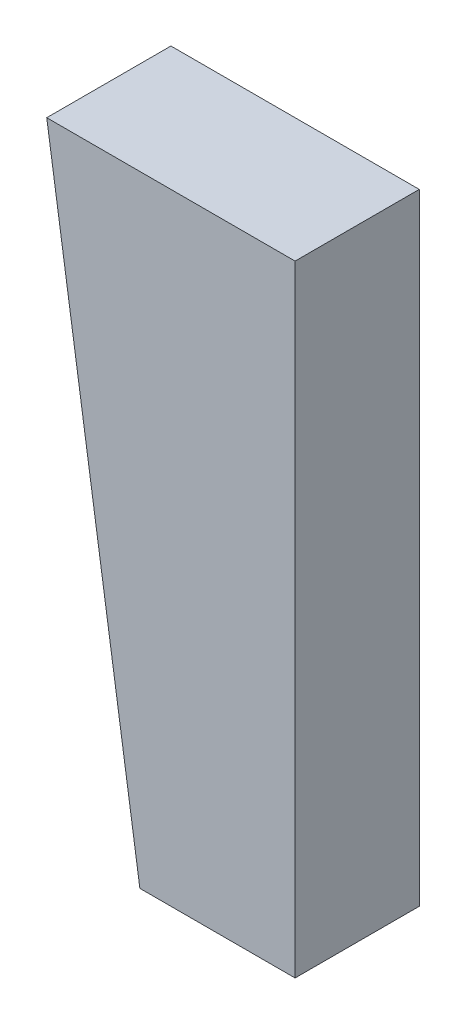
ISO-10303-21;
HEADER;
FILE_DESCRIPTION(('STEP AP214'),'2;1');
FILE_NAME('part.step','',(''),(''),'','','');
FILE_SCHEMA(('AUTOMOTIVE_DESIGN { 1 0 10303 214 1 1 1 1 }'));
ENDSEC;
DATA;
#1=APPLICATION_CONTEXT('core data for automotive mechanical design processes');
#2=APPLICATION_PROTOCOL_DEFINITION('international standard','automotive_design',2000,#1);
#3=PRODUCT_CONTEXT('',#1,'mechanical');
#4=PRODUCT('Part','Part','',(#3));
#5=PRODUCT_RELATED_PRODUCT_CATEGORY('part','',(#4));
#6=PRODUCT_DEFINITION_FORMATION('','',#4);
#7=PRODUCT_DEFINITION_CONTEXT('part definition',#1,'design');
#8=PRODUCT_DEFINITION('design','',#6,#7);
#9=PRODUCT_DEFINITION_SHAPE('','',#8);
#10=(LENGTH_UNIT() NAMED_UNIT(*) SI_UNIT(.MILLI.,.METRE.));
#11=(NAMED_UNIT(*) PLANE_ANGLE_UNIT() SI_UNIT($,.RADIAN.));
#12=(NAMED_UNIT(*) SI_UNIT($,.STERADIAN.) SOLID_ANGLE_UNIT());
#13=UNCERTAINTY_MEASURE_WITH_UNIT(LENGTH_MEASURE(1.E-05),#10,'distance_accuracy_value','');
#14=(GEOMETRIC_REPRESENTATION_CONTEXT(3) GLOBAL_UNCERTAINTY_ASSIGNED_CONTEXT((#13)) GLOBAL_UNIT_ASSIGNED_CONTEXT((#10,
#11,#12)) REPRESENTATION_CONTEXT('',''));
#15=CARTESIAN_POINT('',(0.,0.,0.));
#16=DIRECTION('',(0.,0.,1.));
#17=DIRECTION('',(1.,0.,0.));
#18=AXIS2_PLACEMENT_3D('',#15,#16,#17);
#19=CARTESIAN_POINT('',(0.,20.,4.));
#20=DIRECTION('',(-1.,0.,0.));
#21=DIRECTION('',(0.,-1.,0.));
#22=AXIS2_PLACEMENT_3D('',#19,#20,#21);
#23=PLANE('',#22);
#24=DIRECTION('',(0.,1.,0.));
#25=VECTOR('',#24,1.);
#26=CARTESIAN_POINT('',(0.,20.,0.));
#27=LINE('',#26,#25);
#28=CARTESIAN_POINT('',(0.,0.,0.));
#29=VERTEX_POINT('',#28);
#30=CARTESIAN_POINT('',(0.,20.,0.));
#31=VERTEX_POINT('',#30);
#32=EDGE_CURVE('E99',#29,#31,#27,.T.);
#33=ORIENTED_EDGE('',*,*,#32,.T.);
#34=DIRECTION('',(0.,0.,-1.));
#35=VECTOR('',#34,1.);
#36=CARTESIAN_POINT('',(0.,20.,4.));
#37=LINE('',#36,#35);
#38=CARTESIAN_POINT('',(0.,20.,4.));
#39=VERTEX_POINT('',#38);
#40=EDGE_CURVE('E11',#39,#31,#37,.T.);
#41=ORIENTED_EDGE('',*,*,#40,.F.);
#42=DIRECTION('',(0.,1.,0.));
#43=VECTOR('',#42,1.);
#44=CARTESIAN_POINT('',(0.,20.,4.));
#45=LINE('',#44,#43);
#46=CARTESIAN_POINT('',(0.,0.,4.));
#47=VERTEX_POINT('',#46);
#48=EDGE_CURVE('E87',#47,#39,#45,.T.);
#49=ORIENTED_EDGE('',*,*,#48,.F.);
#50=DIRECTION('',(0.,0.,-1.));
#51=VECTOR('',#50,1.);
#52=CARTESIAN_POINT('',(0.,0.,4.));
#53=LINE('',#52,#51);
#54=EDGE_CURVE('E95',#47,#29,#53,.T.);
#55=ORIENTED_EDGE('',*,*,#54,.T.);
#56=EDGE_LOOP('',(#33,#41,#49,#55));
#57=FACE_BOUND('',#56,.T.);
#58=ADVANCED_FACE('F36',(#57),#23,.F.);
#59=CARTESIAN_POINT('',(-8.,20.,4.));
#60=DIRECTION('',(0.,-1.,0.));
#61=DIRECTION('',(0.,0.,-1.));
#62=AXIS2_PLACEMENT_3D('',#59,#60,#61);
#63=PLANE('',#62);
#64=DIRECTION('',(-1.,0.,0.));
#65=VECTOR('',#64,1.);
#66=CARTESIAN_POINT('',(-8.,20.,0.));
#67=LINE('',#66,#65);
#68=CARTESIAN_POINT('',(-8.,20.,0.));
#69=VERTEX_POINT('',#68);
#70=EDGE_CURVE('E91',#31,#69,#67,.T.);
#71=ORIENTED_EDGE('',*,*,#70,.T.);
#72=DIRECTION('',(0.,0.,-1.));
#73=VECTOR('',#72,1.);
#74=CARTESIAN_POINT('',(-8.,20.,4.));
#75=LINE('',#74,#73);
#76=CARTESIAN_POINT('',(-8.,20.,4.));
#77=VERTEX_POINT('',#76);
#78=EDGE_CURVE('E44',#77,#69,#75,.T.);
#79=ORIENTED_EDGE('',*,*,#78,.F.);
#80=DIRECTION('',(-1.,0.,0.));
#81=VECTOR('',#80,1.);
#82=CARTESIAN_POINT('',(-8.,20.,4.));
#83=LINE('',#82,#81);
#84=EDGE_CURVE('E82',#39,#77,#83,.T.);
#85=ORIENTED_EDGE('',*,*,#84,.F.);
#86=ORIENTED_EDGE('',*,*,#40,.T.);
#87=EDGE_LOOP('',(#71,#79,#85,#86));
#88=FACE_BOUND('',#87,.T.);
#89=ADVANCED_FACE('F90',(#88),#63,.F.);
#90=CARTESIAN_POINT('',(-5.,0.,4.));
#91=DIRECTION('',(0.988936352868298,0.148340452930245,0.));
#92=DIRECTION('',(-0.148340452930245,0.988936352868298,0.));
#93=AXIS2_PLACEMENT_3D('',#90,#91,#92);
#94=PLANE('',#93);
#95=DIRECTION('',(0.148340452930245,-0.988936352868298,0.));
#96=VECTOR('',#95,1.);
#97=CARTESIAN_POINT('',(-5.,0.,0.));
#98=LINE('',#97,#96);
#99=CARTESIAN_POINT('',(-5.,0.,0.));
#100=VERTEX_POINT('',#99);
#101=EDGE_CURVE('E69',#69,#100,#98,.T.);
#102=ORIENTED_EDGE('',*,*,#101,.T.);
#103=DIRECTION('',(0.,0.,-1.));
#104=VECTOR('',#103,1.);
#105=CARTESIAN_POINT('',(-5.,0.,4.));
#106=LINE('',#105,#104);
#107=CARTESIAN_POINT('',(-5.,0.,4.));
#108=VERTEX_POINT('',#107);
#109=EDGE_CURVE('E92',#108,#100,#106,.T.);
#110=ORIENTED_EDGE('',*,*,#109,.F.);
#111=DIRECTION('',(0.148340452930245,-0.988936352868298,0.));
#112=VECTOR('',#111,1.);
#113=CARTESIAN_POINT('',(-5.,0.,4.));
#114=LINE('',#113,#112);
#115=EDGE_CURVE('E85',#77,#108,#114,.T.);
#116=ORIENTED_EDGE('',*,*,#115,.F.);
#117=ORIENTED_EDGE('',*,*,#78,.T.);
#118=EDGE_LOOP('',(#102,#110,#116,#117));
#119=FACE_BOUND('',#118,.T.);
#120=ADVANCED_FACE('F93',(#119),#94,.F.);
#121=CARTESIAN_POINT('',(0.,0.,4.));
#122=DIRECTION('',(0.,1.,0.));
#123=DIRECTION('',(-1.,0.,0.));
#124=AXIS2_PLACEMENT_3D('',#121,#122,#123);
#125=PLANE('',#124);
#126=DIRECTION('',(1.,0.,0.));
#127=VECTOR('',#126,1.);
#128=CARTESIAN_POINT('',(0.,0.,0.));
#129=LINE('',#128,#127);
#130=EDGE_CURVE('E75',#100,#29,#129,.T.);
#131=ORIENTED_EDGE('',*,*,#130,.T.);
#132=ORIENTED_EDGE('',*,*,#54,.F.);
#133=DIRECTION('',(1.,0.,0.));
#134=VECTOR('',#133,1.);
#135=CARTESIAN_POINT('',(0.,0.,4.));
#136=LINE('',#135,#134);
#137=EDGE_CURVE('E52',#108,#47,#136,.T.);
#138=ORIENTED_EDGE('',*,*,#137,.F.);
#139=ORIENTED_EDGE('',*,*,#109,.T.);
#140=EDGE_LOOP('',(#131,#132,#138,#139));
#141=FACE_BOUND('',#140,.T.);
#142=ADVANCED_FACE('F106',(#141),#125,.F.);
#143=CARTESIAN_POINT('',(0.,0.,4.));
#144=DIRECTION('',(0.,0.,-1.));
#145=DIRECTION('',(-1.,0.,0.));
#146=AXIS2_PLACEMENT_3D('',#143,#144,#145);
#147=PLANE('',#146);
#148=ORIENTED_EDGE('',*,*,#48,.T.);
#149=ORIENTED_EDGE('',*,*,#84,.T.);
#150=ORIENTED_EDGE('',*,*,#115,.T.);
#151=ORIENTED_EDGE('',*,*,#137,.T.);
#152=EDGE_LOOP('',(#148,#149,#150,#151));
#153=FACE_BOUND('',#152,.T.);
#154=ADVANCED_FACE('F83',(#153),#147,.F.);
#155=CARTESIAN_POINT('',(0.,0.,0.));
#156=DIRECTION('',(0.,0.,-1.));
#157=DIRECTION('',(-1.,0.,0.));
#158=AXIS2_PLACEMENT_3D('',#155,#156,#157);
#159=PLANE('',#158);
#160=ORIENTED_EDGE('',*,*,#32,.F.);
#161=ORIENTED_EDGE('',*,*,#130,.F.);
#162=ORIENTED_EDGE('',*,*,#101,.F.);
#163=ORIENTED_EDGE('',*,*,#70,.F.);
#164=EDGE_LOOP('',(#160,#161,#162,#163));
#165=FACE_BOUND('',#164,.T.);
#166=ADVANCED_FACE('F109',(#165),#159,.T.);
#167=CLOSED_SHELL('',(#58,#89,#120,#142,#154,#166));
#168=MANIFOLD_SOLID_BREP('B2',#167);
#169=ADVANCED_BREP_SHAPE_REPRESENTATION('',(#18,#168),#14);
#170=SHAPE_DEFINITION_REPRESENTATION(#9,#169);
ENDSEC;
END-ISO-10303-21;
